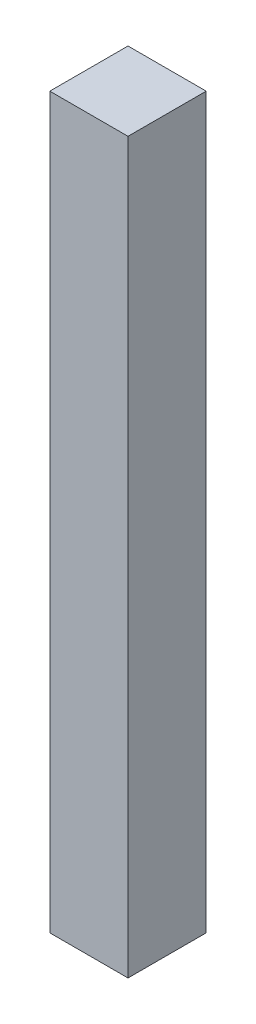
ISO-10303-21;
HEADER;
FILE_DESCRIPTION(('STEP AP214'),'2;1');
FILE_NAME('part.step','',(''),(''),'','','');
FILE_SCHEMA(('AUTOMOTIVE_DESIGN { 1 0 10303 214 1 1 1 1 }'));
ENDSEC;
DATA;
#1=APPLICATION_CONTEXT('core data for automotive mechanical design processes');
#2=APPLICATION_PROTOCOL_DEFINITION('international standard','automotive_design',2000,#1);
#3=PRODUCT_CONTEXT('',#1,'mechanical');
#4=PRODUCT('Part','Part','',(#3));
#5=PRODUCT_RELATED_PRODUCT_CATEGORY('part','',(#4));
#6=PRODUCT_DEFINITION_FORMATION('','',#4);
#7=PRODUCT_DEFINITION_CONTEXT('part definition',#1,'design');
#8=PRODUCT_DEFINITION('design','',#6,#7);
#9=PRODUCT_DEFINITION_SHAPE('','',#8);
#10=(LENGTH_UNIT() NAMED_UNIT(*) SI_UNIT(.MILLI.,.METRE.));
#11=(NAMED_UNIT(*) PLANE_ANGLE_UNIT() SI_UNIT($,.RADIAN.));
#12=(NAMED_UNIT(*) SI_UNIT($,.STERADIAN.) SOLID_ANGLE_UNIT());
#13=UNCERTAINTY_MEASURE_WITH_UNIT(LENGTH_MEASURE(1.E-05),#10,'distance_accuracy_value','');
#14=(GEOMETRIC_REPRESENTATION_CONTEXT(3) GLOBAL_UNCERTAINTY_ASSIGNED_CONTEXT((#13)) GLOBAL_UNIT_ASSIGNED_CONTEXT((#10,
#11,#12)) REPRESENTATION_CONTEXT('',''));
#15=CARTESIAN_POINT('',(0.,0.,0.));
#16=DIRECTION('',(0.,0.,1.));
#17=DIRECTION('',(1.,0.,0.));
#18=AXIS2_PLACEMENT_3D('',#15,#16,#17);
#19=CARTESIAN_POINT('',(508.,-828.675,1016.));
#20=DIRECTION('',(-1.,0.,0.));
#21=DIRECTION('',(0.,0.,-1.));
#22=AXIS2_PLACEMENT_3D('',#19,#20,#21);
#23=PLANE('',#22);
#24=DIRECTION('',(0.,0.,-1.));
#25=VECTOR('',#24,1.);
#26=CARTESIAN_POINT('',(508.,0.,1016.));
#27=LINE('',#26,#25);
#28=CARTESIAN_POINT('',(508.,0.,1016.));
#29=VERTEX_POINT('',#28);
#30=CARTESIAN_POINT('',(508.,0.,927.1));
#31=VERTEX_POINT('',#30);
#32=EDGE_CURVE('E95',#29,#31,#27,.T.);
#33=ORIENTED_EDGE('',*,*,#32,.F.);
#34=DIRECTION('',(0.,1.,0.));
#35=VECTOR('',#34,1.);
#36=CARTESIAN_POINT('',(508.,-828.675,1016.));
#37=LINE('',#36,#35);
#38=CARTESIAN_POINT('',(508.,-828.675,1016.));
#39=VERTEX_POINT('',#38);
#40=EDGE_CURVE('E110',#39,#29,#37,.T.);
#41=ORIENTED_EDGE('',*,*,#40,.F.);
#42=DIRECTION('',(0.,0.,-1.));
#43=VECTOR('',#42,1.);
#44=CARTESIAN_POINT('',(508.,-828.675,1016.));
#45=LINE('',#44,#43);
#46=CARTESIAN_POINT('',(508.,-828.675,927.1));
#47=VERTEX_POINT('',#46);
#48=EDGE_CURVE('E103',#39,#47,#45,.T.);
#49=ORIENTED_EDGE('',*,*,#48,.T.);
#50=DIRECTION('',(0.,1.,0.));
#51=VECTOR('',#50,1.);
#52=CARTESIAN_POINT('',(508.,-828.675,927.1));
#53=LINE('',#52,#51);
#54=EDGE_CURVE('E11',#47,#31,#53,.T.);
#55=ORIENTED_EDGE('',*,*,#54,.T.);
#56=EDGE_LOOP('',(#33,#41,#49,#55));
#57=FACE_BOUND('',#56,.T.);
#58=ADVANCED_FACE('F38',(#57),#23,.F.);
#59=CARTESIAN_POINT('',(508.,-828.675,927.1));
#60=DIRECTION('',(0.,0.,1.));
#61=DIRECTION('',(-1.,0.,0.));
#62=AXIS2_PLACEMENT_3D('',#59,#60,#61);
#63=PLANE('',#62);
#64=DIRECTION('',(-1.,0.,0.));
#65=VECTOR('',#64,1.);
#66=CARTESIAN_POINT('',(508.,0.,927.1));
#67=LINE('',#66,#65);
#68=CARTESIAN_POINT('',(419.1,0.,927.1));
#69=VERTEX_POINT('',#68);
#70=EDGE_CURVE('E98',#31,#69,#67,.T.);
#71=ORIENTED_EDGE('',*,*,#70,.F.);
#72=ORIENTED_EDGE('',*,*,#54,.F.);
#73=DIRECTION('',(-1.,0.,0.));
#74=VECTOR('',#73,1.);
#75=CARTESIAN_POINT('',(508.,-828.675,927.1));
#76=LINE('',#75,#74);
#77=CARTESIAN_POINT('',(419.1,-828.675,927.1));
#78=VERTEX_POINT('',#77);
#79=EDGE_CURVE('E80',#47,#78,#76,.T.);
#80=ORIENTED_EDGE('',*,*,#79,.T.);
#81=DIRECTION('',(0.,1.,0.));
#82=VECTOR('',#81,1.);
#83=CARTESIAN_POINT('',(419.1,-828.675,927.1));
#84=LINE('',#83,#82);
#85=EDGE_CURVE('E46',#78,#69,#84,.T.);
#86=ORIENTED_EDGE('',*,*,#85,.T.);
#87=EDGE_LOOP('',(#71,#72,#80,#86));
#88=FACE_BOUND('',#87,.T.);
#89=ADVANCED_FACE('F122',(#88),#63,.F.);
#90=CARTESIAN_POINT('',(419.1,-828.675,1016.));
#91=DIRECTION('',(1.,0.,0.));
#92=DIRECTION('',(0.,0.,1.));
#93=AXIS2_PLACEMENT_3D('',#90,#91,#92);
#94=PLANE('',#93);
#95=DIRECTION('',(0.,0.,1.));
#96=VECTOR('',#95,1.);
#97=CARTESIAN_POINT('',(419.1,0.,1016.));
#98=LINE('',#97,#96);
#99=CARTESIAN_POINT('',(419.1,0.,1016.));
#100=VERTEX_POINT('',#99);
#101=EDGE_CURVE('E114',#69,#100,#98,.T.);
#102=ORIENTED_EDGE('',*,*,#101,.F.);
#103=ORIENTED_EDGE('',*,*,#85,.F.);
#104=DIRECTION('',(0.,0.,1.));
#105=VECTOR('',#104,1.);
#106=CARTESIAN_POINT('',(419.1,-828.675,1016.));
#107=LINE('',#106,#105);
#108=CARTESIAN_POINT('',(419.1,-828.675,1016.));
#109=VERTEX_POINT('',#108);
#110=EDGE_CURVE('E107',#78,#109,#107,.T.);
#111=ORIENTED_EDGE('',*,*,#110,.T.);
#112=DIRECTION('',(0.,1.,0.));
#113=VECTOR('',#112,1.);
#114=CARTESIAN_POINT('',(419.1,-828.675,1016.));
#115=LINE('',#114,#113);
#116=EDGE_CURVE('E118',#109,#100,#115,.T.);
#117=ORIENTED_EDGE('',*,*,#116,.T.);
#118=EDGE_LOOP('',(#102,#103,#111,#117));
#119=FACE_BOUND('',#118,.T.);
#120=ADVANCED_FACE('F129',(#119),#94,.F.);
#121=CARTESIAN_POINT('',(508.,-828.675,1016.));
#122=DIRECTION('',(0.,0.,-1.));
#123=DIRECTION('',(1.,0.,0.));
#124=AXIS2_PLACEMENT_3D('',#121,#122,#123);
#125=PLANE('',#124);
#126=DIRECTION('',(1.,0.,0.));
#127=VECTOR('',#126,1.);
#128=CARTESIAN_POINT('',(508.,0.,1016.));
#129=LINE('',#128,#127);
#130=EDGE_CURVE('E69',#100,#29,#129,.T.);
#131=ORIENTED_EDGE('',*,*,#130,.F.);
#132=ORIENTED_EDGE('',*,*,#116,.F.);
#133=DIRECTION('',(1.,0.,0.));
#134=VECTOR('',#133,1.);
#135=CARTESIAN_POINT('',(508.,-828.675,1016.));
#136=LINE('',#135,#134);
#137=EDGE_CURVE('E54',#109,#39,#136,.T.);
#138=ORIENTED_EDGE('',*,*,#137,.T.);
#139=ORIENTED_EDGE('',*,*,#40,.T.);
#140=EDGE_LOOP('',(#131,#132,#138,#139));
#141=FACE_BOUND('',#140,.T.);
#142=ADVANCED_FACE('F128',(#141),#125,.F.);
#143=CARTESIAN_POINT('',(0.,-828.675,0.));
#144=DIRECTION('',(0.,-1.,0.));
#145=DIRECTION('',(0.,0.,-1.));
#146=AXIS2_PLACEMENT_3D('',#143,#144,#145);
#147=PLANE('',#146);
#148=CARTESIAN_POINT('',(463.55,-828.675,971.55));
#149=DIRECTION('',(0.,1.,0.));
#150=DIRECTION('',(0.,0.,-1.));
#151=AXIS2_PLACEMENT_3D('',#148,#149,#150);
#152=CIRCLE('',#151,6.35000000000002);
#153=CARTESIAN_POINT('',(463.55,-828.675,965.2));
#154=VERTEX_POINT('',#153);
#155=EDGE_CURVE('E96',#154,#154,#152,.T.);
#156=ORIENTED_EDGE('',*,*,#155,.T.);
#157=EDGE_LOOP('',(#156));
#158=FACE_BOUND('',#157,.T.);
#159=ORIENTED_EDGE('',*,*,#48,.F.);
#160=ORIENTED_EDGE('',*,*,#137,.F.);
#161=ORIENTED_EDGE('',*,*,#110,.F.);
#162=ORIENTED_EDGE('',*,*,#79,.F.);
#163=EDGE_LOOP('',(#159,#160,#161,#162));
#164=FACE_BOUND('',#163,.T.);
#165=ADVANCED_FACE('F127',(#158,#164),#147,.T.);
#166=CARTESIAN_POINT('',(0.,0.,0.));
#167=DIRECTION('',(0.,-1.,0.));
#168=DIRECTION('',(0.,0.,-1.));
#169=AXIS2_PLACEMENT_3D('',#166,#167,#168);
#170=PLANE('',#169);
#171=ORIENTED_EDGE('',*,*,#32,.T.);
#172=ORIENTED_EDGE('',*,*,#70,.T.);
#173=ORIENTED_EDGE('',*,*,#101,.T.);
#174=ORIENTED_EDGE('',*,*,#130,.T.);
#175=EDGE_LOOP('',(#171,#172,#173,#174));
#176=FACE_BOUND('',#175,.T.);
#177=ADVANCED_FACE('F89',(#176),#170,.F.);
#178=CARTESIAN_POINT('',(463.55,-824.611,971.55));
#179=DIRECTION('',(0.,-1.,0.));
#180=DIRECTION('',(0.,0.,-1.));
#181=AXIS2_PLACEMENT_3D('',#178,#179,#180);
#182=CONICAL_SURFACE('',#181,6.35000000000002,1.02974425867665);
#183=CARTESIAN_POINT('',(463.55,-820.795535069175,971.55));
#184=VERTEX_POINT('',#183);
#185=VERTEX_LOOP('',#184);
#186=FACE_BOUND('',#185,.T.);
#187=CARTESIAN_POINT('',(463.55,-824.611,971.55));
#188=DIRECTION('',(0.,1.,0.));
#189=DIRECTION('',(0.,0.,-1.));
#190=AXIS2_PLACEMENT_3D('',#187,#188,#189);
#191=CIRCLE('',#190,6.35000000000002);
#192=CARTESIAN_POINT('',(463.55,-824.611,965.2));
#193=VERTEX_POINT('',#192);
#194=EDGE_CURVE('E93',#193,#193,#191,.T.);
#195=ORIENTED_EDGE('',*,*,#194,.F.);
#196=EDGE_LOOP('',(#195));
#197=FACE_BOUND('',#196,.T.);
#198=ADVANCED_FACE('F85',(#186,#197),#182,.F.);
#199=CARTESIAN_POINT('',(463.55,-828.675,971.55));
#200=DIRECTION('',(0.,-1.,0.));
#201=DIRECTION('',(0.,0.,-1.));
#202=AXIS2_PLACEMENT_3D('',#199,#200,#201);
#203=CYLINDRICAL_SURFACE('',#202,6.35000000000002);
#204=ORIENTED_EDGE('',*,*,#194,.T.);
#205=EDGE_LOOP('',(#204));
#206=FACE_BOUND('',#205,.T.);
#207=ORIENTED_EDGE('',*,*,#155,.F.);
#208=EDGE_LOOP('',(#207));
#209=FACE_BOUND('',#208,.T.);
#210=ADVANCED_FACE('F88',(#206,#209),#203,.F.);
#211=CLOSED_SHELL('',(#58,#89,#120,#142,#165,#177,#198,#210));
#212=MANIFOLD_SOLID_BREP('B2',#211);
#213=ADVANCED_BREP_SHAPE_REPRESENTATION('',(#18,#212),#14);
#214=SHAPE_DEFINITION_REPRESENTATION(#9,#213);
ENDSEC;
END-ISO-10303-21;
